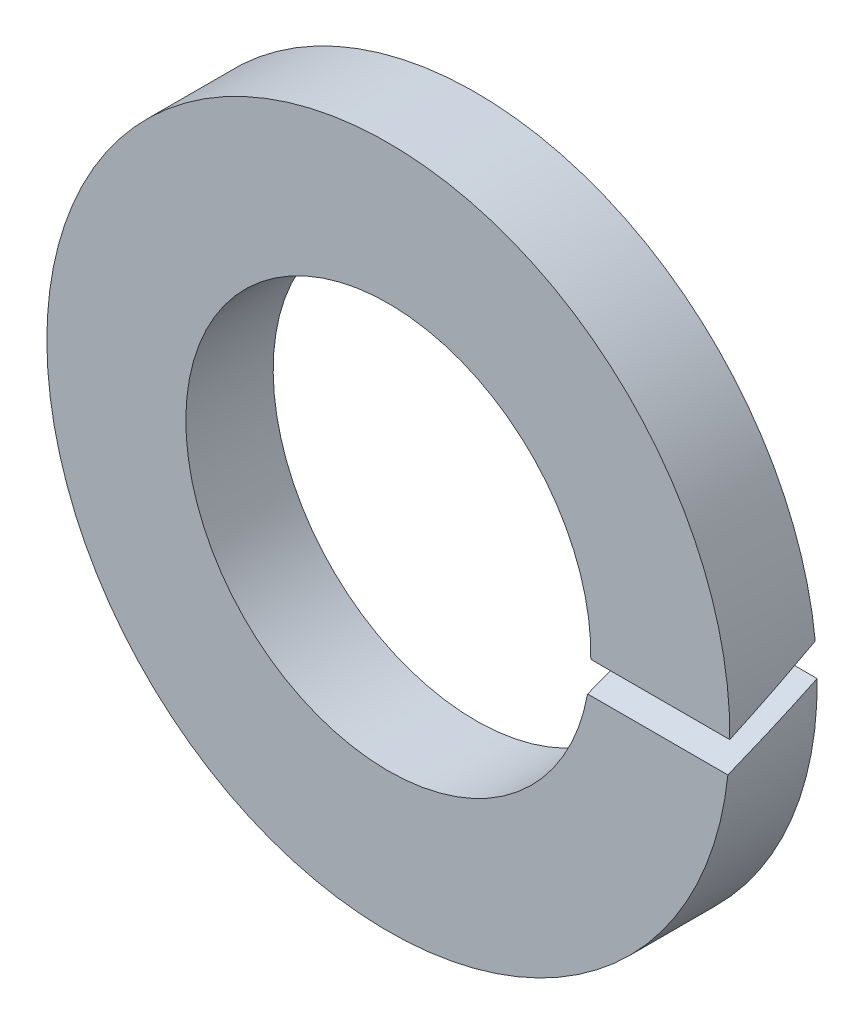
ISO-10303-21;
HEADER;
FILE_DESCRIPTION(('STEP AP214'),'2;1');
FILE_NAME('part.step','',(''),(''),'','','');
FILE_SCHEMA(('AUTOMOTIVE_DESIGN { 1 0 10303 214 1 1 1 1 }'));
ENDSEC;
DATA;
#1=APPLICATION_CONTEXT('core data for automotive mechanical design processes');
#2=APPLICATION_PROTOCOL_DEFINITION('international standard','automotive_design',2000,#1);
#3=PRODUCT_CONTEXT('',#1,'mechanical');
#4=PRODUCT('Part','Part','',(#3));
#5=PRODUCT_RELATED_PRODUCT_CATEGORY('part','',(#4));
#6=PRODUCT_DEFINITION_FORMATION('','',#4);
#7=PRODUCT_DEFINITION_CONTEXT('part definition',#1,'design');
#8=PRODUCT_DEFINITION('design','',#6,#7);
#9=PRODUCT_DEFINITION_SHAPE('','',#8);
#10=(LENGTH_UNIT() NAMED_UNIT(*) SI_UNIT(.MILLI.,.METRE.));
#11=(NAMED_UNIT(*) PLANE_ANGLE_UNIT() SI_UNIT($,.RADIAN.));
#12=(NAMED_UNIT(*) SI_UNIT($,.STERADIAN.) SOLID_ANGLE_UNIT());
#13=UNCERTAINTY_MEASURE_WITH_UNIT(LENGTH_MEASURE(1.E-05),#10,'distance_accuracy_value','');
#14=(GEOMETRIC_REPRESENTATION_CONTEXT(3) GLOBAL_UNCERTAINTY_ASSIGNED_CONTEXT((#13)) GLOBAL_UNIT_ASSIGNED_CONTEXT((#10,
#11,#12)) REPRESENTATION_CONTEXT('',''));
#15=CARTESIAN_POINT('',(0.,0.,0.));
#16=DIRECTION('',(0.,0.,1.));
#17=DIRECTION('',(1.,0.,0.));
#18=AXIS2_PLACEMENT_3D('',#15,#16,#17);
#19=CARTESIAN_POINT('',(0.,0.,2.2));
#20=DIRECTION('',(0.,0.,1.));
#21=DIRECTION('',(1.,0.,0.));
#22=AXIS2_PLACEMENT_3D('',#19,#20,#21);
#23=PLANE('',#22);
#24=CARTESIAN_POINT('',(0.,0.,2.2));
#25=DIRECTION('',(0.,0.,1.));
#26=DIRECTION('',(1.,0.,0.));
#27=AXIS2_PLACEMENT_3D('',#24,#25,#26);
#28=CIRCLE('',#27,5.1);
#29=CARTESIAN_POINT('',(5.09868692237069,-0.115722373144007,2.2));
#30=VERTEX_POINT('',#29);
#31=CARTESIAN_POINT('',(5.0181290170747,-0.910154474797004,2.2));
#32=VERTEX_POINT('',#31);
#33=EDGE_CURVE('E93',#30,#32,#28,.T.);
#34=ORIENTED_EDGE('',*,*,#33,.F.);
#35=DIRECTION('',(-1.,0.,0.));
#36=VECTOR('',#35,1.);
#37=CARTESIAN_POINT('',(8.6,-0.115722373144007,2.2));
#38=LINE('',#37,#36);
#39=CARTESIAN_POINT('',(8.59922137942464,-0.115722373144007,2.2));
#40=VERTEX_POINT('',#39);
#41=EDGE_CURVE('E56',#40,#30,#38,.T.);
#42=ORIENTED_EDGE('',*,*,#41,.F.);
#43=CARTESIAN_POINT('',(0.,0.,2.2));
#44=DIRECTION('',(0.,0.,1.));
#45=DIRECTION('',(1.,0.,0.));
#46=AXIS2_PLACEMENT_3D('',#43,#44,#45);
#47=CIRCLE('',#46,8.6);
#48=CARTESIAN_POINT('',(8.55170268613258,-0.910154474797004,2.2));
#49=VERTEX_POINT('',#48);
#50=EDGE_CURVE('E92',#40,#49,#47,.T.);
#51=ORIENTED_EDGE('',*,*,#50,.T.);
#52=DIRECTION('',(-1.,0.,0.));
#53=VECTOR('',#52,1.);
#54=CARTESIAN_POINT('',(8.6,-0.910154474797004,2.2));
#55=LINE('',#54,#53);
#56=EDGE_CURVE('E74',#49,#32,#55,.T.);
#57=ORIENTED_EDGE('',*,*,#56,.T.);
#58=EDGE_LOOP('',(#34,#42,#51,#57));
#59=FACE_BOUND('',#58,.T.);
#60=ADVANCED_FACE('F33',(#59),#23,.T.);
#61=CARTESIAN_POINT('',(0.,0.,0.));
#62=DIRECTION('',(0.,0.,1.));
#63=DIRECTION('',(1.,0.,0.));
#64=AXIS2_PLACEMENT_3D('',#61,#62,#63);
#65=PLANE('',#64);
#66=DIRECTION('',(-1.,0.,0.));
#67=VECTOR('',#66,1.);
#68=CARTESIAN_POINT('',(8.6,0.910154474797004,0.));
#69=LINE('',#68,#67);
#70=CARTESIAN_POINT('',(8.55170268613258,0.910154474797004,0.));
#71=VERTEX_POINT('',#70);
#72=CARTESIAN_POINT('',(5.0181290170747,0.910154474797004,0.));
#73=VERTEX_POINT('',#72);
#74=EDGE_CURVE('E80',#71,#73,#69,.T.);
#75=ORIENTED_EDGE('',*,*,#74,.T.);
#76=CARTESIAN_POINT('',(0.,0.,0.));
#77=DIRECTION('',(0.,0.,1.));
#78=DIRECTION('',(1.,0.,0.));
#79=AXIS2_PLACEMENT_3D('',#76,#77,#78);
#80=CIRCLE('',#79,5.1);
#81=CARTESIAN_POINT('',(5.09868692237069,0.115722373144007,0.));
#82=VERTEX_POINT('',#81);
#83=EDGE_CURVE('E89',#73,#82,#80,.T.);
#84=ORIENTED_EDGE('',*,*,#83,.T.);
#85=DIRECTION('',(-1.,0.,0.));
#86=VECTOR('',#85,1.);
#87=CARTESIAN_POINT('',(8.6,0.115722373144007,0.));
#88=LINE('',#87,#86);
#89=CARTESIAN_POINT('',(8.59922137942465,0.115722373144007,0.));
#90=VERTEX_POINT('',#89);
#91=EDGE_CURVE('E48',#90,#82,#88,.T.);
#92=ORIENTED_EDGE('',*,*,#91,.F.);
#93=CARTESIAN_POINT('',(0.,0.,0.));
#94=DIRECTION('',(0.,0.,1.));
#95=DIRECTION('',(1.,0.,0.));
#96=AXIS2_PLACEMENT_3D('',#93,#94,#95);
#97=CIRCLE('',#96,8.6);
#98=EDGE_CURVE('E87',#71,#90,#97,.T.);
#99=ORIENTED_EDGE('',*,*,#98,.F.);
#100=EDGE_LOOP('',(#75,#84,#92,#99));
#101=FACE_BOUND('',#100,.T.);
#102=ADVANCED_FACE('F86',(#101),#65,.F.);
#103=CARTESIAN_POINT('',(0.,0.,2.2));
#104=DIRECTION('',(0.,0.,-1.));
#105=DIRECTION('',(-1.,0.,0.));
#106=AXIS2_PLACEMENT_3D('',#103,#104,#105);
#107=CYLINDRICAL_SURFACE('',#106,8.6);
#108=CARTESIAN_POINT('',(0.,0.,1.95183256993489));
#109=DIRECTION('',(0.,-0.906307787036648,-0.422618261740704));
#110=DIRECTION('',(0.,0.422618261740704,-0.906307787036648));
#111=AXIS2_PLACEMENT_3D('',#108,#109,#110);
#112=ELLIPSE('',#111,20.3493336151113,8.6);
#113=EDGE_CURVE('E79',#71,#40,#112,.T.);
#114=ORIENTED_EDGE('',*,*,#113,.F.);
#115=ORIENTED_EDGE('',*,*,#98,.T.);
#116=CARTESIAN_POINT('',(0.,0.,0.24816743006511));
#117=DIRECTION('',(0.,0.906307787036648,0.422618261740704));
#118=DIRECTION('',(0.,0.422618261740704,-0.906307787036648));
#119=AXIS2_PLACEMENT_3D('',#116,#117,#118);
#120=ELLIPSE('',#119,20.3493336151113,8.6);
#121=EDGE_CURVE('E71',#49,#90,#120,.T.);
#122=ORIENTED_EDGE('',*,*,#121,.F.);
#123=ORIENTED_EDGE('',*,*,#50,.F.);
#124=EDGE_LOOP('',(#114,#115,#122,#123));
#125=FACE_BOUND('',#124,.T.);
#126=ADVANCED_FACE('F35',(#125),#107,.T.);
#127=CARTESIAN_POINT('',(0.,0.,2.2));
#128=DIRECTION('',(0.,0.,-1.));
#129=DIRECTION('',(-1.,0.,0.));
#130=AXIS2_PLACEMENT_3D('',#127,#128,#129);
#131=CYLINDRICAL_SURFACE('',#130,5.1);
#132=ORIENTED_EDGE('',*,*,#83,.F.);
#133=CARTESIAN_POINT('',(0.,0.,1.95183256993489));
#134=DIRECTION('',(0.,-0.906307787036648,-0.422618261740704));
#135=DIRECTION('',(0.,0.422618261740704,-0.906307787036648));
#136=AXIS2_PLACEMENT_3D('',#133,#134,#135);
#137=ELLIPSE('',#136,12.0676280740776,5.1);
#138=EDGE_CURVE('E11',#73,#30,#137,.T.);
#139=ORIENTED_EDGE('',*,*,#138,.T.);
#140=ORIENTED_EDGE('',*,*,#33,.T.);
#141=CARTESIAN_POINT('',(0.,0.,0.24816743006511));
#142=DIRECTION('',(0.,0.906307787036648,0.422618261740704));
#143=DIRECTION('',(0.,0.422618261740704,-0.906307787036648));
#144=AXIS2_PLACEMENT_3D('',#141,#142,#143);
#145=ELLIPSE('',#144,12.0676280740776,5.1);
#146=EDGE_CURVE('E41',#32,#82,#145,.T.);
#147=ORIENTED_EDGE('',*,*,#146,.T.);
#148=EDGE_LOOP('',(#132,#139,#140,#147));
#149=FACE_BOUND('',#148,.T.);
#150=ADVANCED_FACE('F100',(#149),#131,.F.);
#151=CARTESIAN_POINT('',(8.6,0.115722373144007,0.));
#152=DIRECTION('',(0.,0.906307787036648,0.422618261740704));
#153=DIRECTION('',(0.,-0.422618261740704,0.906307787036648));
#154=AXIS2_PLACEMENT_3D('',#151,#152,#153);
#155=PLANE('',#154);
#156=ORIENTED_EDGE('',*,*,#121,.T.);
#157=ORIENTED_EDGE('',*,*,#91,.T.);
#158=ORIENTED_EDGE('',*,*,#146,.F.);
#159=ORIENTED_EDGE('',*,*,#56,.F.);
#160=EDGE_LOOP('',(#156,#157,#158,#159));
#161=FACE_BOUND('',#160,.T.);
#162=ADVANCED_FACE('F72',(#161),#155,.T.);
#163=CARTESIAN_POINT('',(8.6,0.910154474797004,0.));
#164=DIRECTION('',(0.,-0.906307787036648,-0.422618261740704));
#165=DIRECTION('',(0.,0.422618261740704,-0.906307787036648));
#166=AXIS2_PLACEMENT_3D('',#163,#164,#165);
#167=PLANE('',#166);
#168=ORIENTED_EDGE('',*,*,#113,.T.);
#169=ORIENTED_EDGE('',*,*,#41,.T.);
#170=ORIENTED_EDGE('',*,*,#138,.F.);
#171=ORIENTED_EDGE('',*,*,#74,.F.);
#172=EDGE_LOOP('',(#168,#169,#170,#171));
#173=FACE_BOUND('',#172,.T.);
#174=ADVANCED_FACE('F107',(#173),#167,.T.);
#175=CLOSED_SHELL('',(#60,#102,#126,#150,#162,#174));
#176=MANIFOLD_SOLID_BREP('B2',#175);
#177=ADVANCED_BREP_SHAPE_REPRESENTATION('',(#18,#176),#14);
#178=SHAPE_DEFINITION_REPRESENTATION(#9,#177);
ENDSEC;
END-ISO-10303-21;
